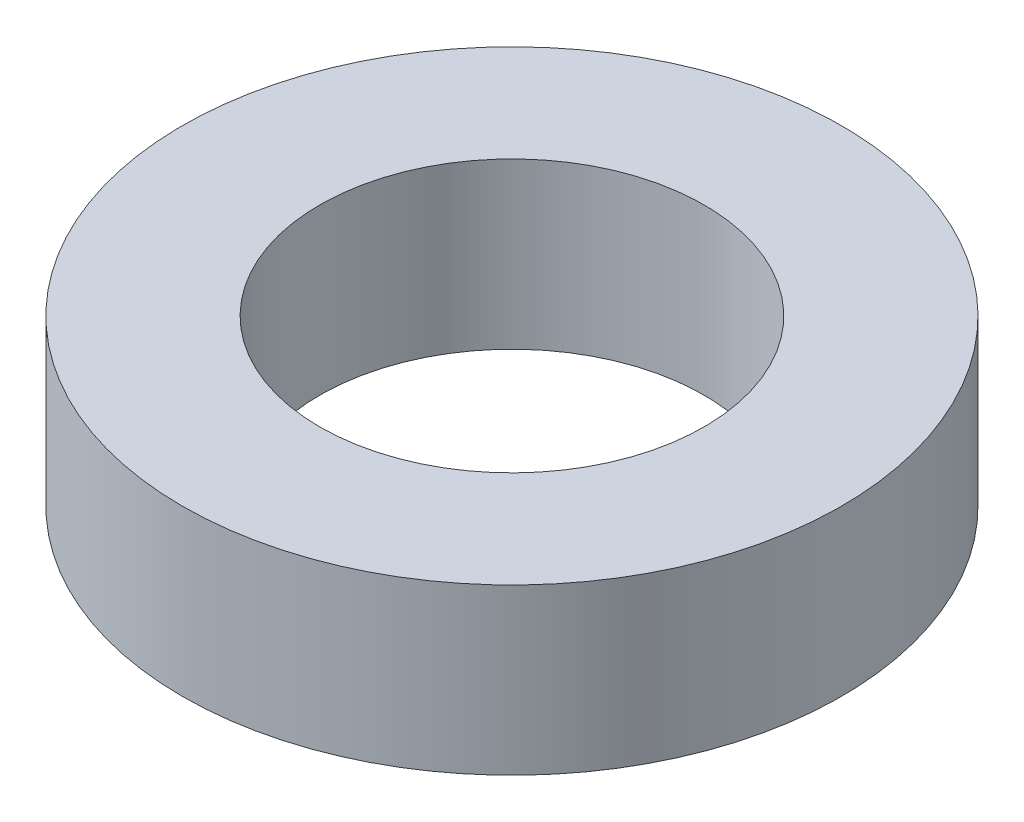
ISO-10303-21;
HEADER;
FILE_DESCRIPTION(('STEP AP214'),'2;1');
FILE_NAME('part.step','',(''),(''),'','','');
FILE_SCHEMA(('AUTOMOTIVE_DESIGN { 1 0 10303 214 1 1 1 1 }'));
ENDSEC;
DATA;
#1=APPLICATION_CONTEXT('core data for automotive mechanical design processes');
#2=APPLICATION_PROTOCOL_DEFINITION('international standard','automotive_design',2000,#1);
#3=PRODUCT_CONTEXT('',#1,'mechanical');
#4=PRODUCT('Part','Part','',(#3));
#5=PRODUCT_RELATED_PRODUCT_CATEGORY('part','',(#4));
#6=PRODUCT_DEFINITION_FORMATION('','',#4);
#7=PRODUCT_DEFINITION_CONTEXT('part definition',#1,'design');
#8=PRODUCT_DEFINITION('design','',#6,#7);
#9=PRODUCT_DEFINITION_SHAPE('','',#8);
#10=(LENGTH_UNIT() NAMED_UNIT(*) SI_UNIT(.MILLI.,.METRE.));
#11=(NAMED_UNIT(*) PLANE_ANGLE_UNIT() SI_UNIT($,.RADIAN.));
#12=(NAMED_UNIT(*) SI_UNIT($,.STERADIAN.) SOLID_ANGLE_UNIT());
#13=UNCERTAINTY_MEASURE_WITH_UNIT(LENGTH_MEASURE(1.E-05),#10,'distance_accuracy_value','');
#14=(GEOMETRIC_REPRESENTATION_CONTEXT(3) GLOBAL_UNCERTAINTY_ASSIGNED_CONTEXT((#13)) GLOBAL_UNIT_ASSIGNED_CONTEXT((#10,
#11,#12)) REPRESENTATION_CONTEXT('',''));
#15=CARTESIAN_POINT('',(0.,0.,0.));
#16=DIRECTION('',(0.,0.,1.));
#17=DIRECTION('',(1.,0.,0.));
#18=AXIS2_PLACEMENT_3D('',#15,#16,#17);
#19=CARTESIAN_POINT('',(0.,1.5,0.));
#20=DIRECTION('',(0.,1.,0.));
#21=DIRECTION('',(0.,0.,1.));
#22=AXIS2_PLACEMENT_3D('',#19,#20,#21);
#23=PLANE('',#22);
#24=CARTESIAN_POINT('',(0.,1.5,0.));
#25=DIRECTION('',(0.,1.,0.));
#26=DIRECTION('',(0.,0.,1.));
#27=AXIS2_PLACEMENT_3D('',#24,#25,#26);
#28=CIRCLE('',#27,3.);
#29=CARTESIAN_POINT('',(0.,1.5,3.));
#30=VERTEX_POINT('',#29);
#31=EDGE_CURVE('E10',#30,#30,#28,.T.);
#32=ORIENTED_EDGE('',*,*,#31,.T.);
#33=EDGE_LOOP('',(#32));
#34=FACE_BOUND('',#33,.T.);
#35=CARTESIAN_POINT('',(0.,1.5,0.));
#36=DIRECTION('',(0.,1.,0.));
#37=DIRECTION('',(0.,0.,1.));
#38=AXIS2_PLACEMENT_3D('',#35,#36,#37);
#39=CIRCLE('',#38,1.75);
#40=CARTESIAN_POINT('',(0.,1.5,1.75));
#41=VERTEX_POINT('',#40);
#42=EDGE_CURVE('E52',#41,#41,#39,.T.);
#43=ORIENTED_EDGE('',*,*,#42,.F.);
#44=EDGE_LOOP('',(#43));
#45=FACE_BOUND('',#44,.T.);
#46=ADVANCED_FACE('F39',(#34,#45),#23,.T.);
#47=CARTESIAN_POINT('',(0.,0.,0.));
#48=DIRECTION('',(0.,1.,0.));
#49=DIRECTION('',(0.,0.,1.));
#50=AXIS2_PLACEMENT_3D('',#47,#48,#49);
#51=PLANE('',#50);
#52=CARTESIAN_POINT('',(0.,0.,0.));
#53=DIRECTION('',(0.,1.,0.));
#54=DIRECTION('',(0.,0.,1.));
#55=AXIS2_PLACEMENT_3D('',#52,#53,#54);
#56=CIRCLE('',#55,3.);
#57=CARTESIAN_POINT('',(0.,0.,3.));
#58=VERTEX_POINT('',#57);
#59=EDGE_CURVE('E43',#58,#58,#56,.T.);
#60=ORIENTED_EDGE('',*,*,#59,.F.);
#61=EDGE_LOOP('',(#60));
#62=FACE_BOUND('',#61,.T.);
#63=CARTESIAN_POINT('',(0.,0.,0.));
#64=DIRECTION('',(0.,1.,0.));
#65=DIRECTION('',(0.,0.,1.));
#66=AXIS2_PLACEMENT_3D('',#63,#64,#65);
#67=CIRCLE('',#66,1.75);
#68=CARTESIAN_POINT('',(0.,0.,1.75));
#69=VERTEX_POINT('',#68);
#70=EDGE_CURVE('E54',#69,#69,#67,.T.);
#71=ORIENTED_EDGE('',*,*,#70,.T.);
#72=EDGE_LOOP('',(#71));
#73=FACE_BOUND('',#72,.T.);
#74=ADVANCED_FACE('F66',(#62,#73),#51,.F.);
#75=CARTESIAN_POINT('',(0.,1.5,0.));
#76=DIRECTION('',(0.,-1.,0.));
#77=DIRECTION('',(0.,0.,-1.));
#78=AXIS2_PLACEMENT_3D('',#75,#76,#77);
#79=CYLINDRICAL_SURFACE('',#78,3.);
#80=ORIENTED_EDGE('',*,*,#31,.F.);
#81=EDGE_LOOP('',(#80));
#82=FACE_BOUND('',#81,.T.);
#83=ORIENTED_EDGE('',*,*,#59,.T.);
#84=EDGE_LOOP('',(#83));
#85=FACE_BOUND('',#84,.T.);
#86=ADVANCED_FACE('F41',(#82,#85),#79,.T.);
#87=CARTESIAN_POINT('',(0.,1.5,0.));
#88=DIRECTION('',(0.,-1.,0.));
#89=DIRECTION('',(0.,0.,-1.));
#90=AXIS2_PLACEMENT_3D('',#87,#88,#89);
#91=CYLINDRICAL_SURFACE('',#90,1.75);
#92=ORIENTED_EDGE('',*,*,#42,.T.);
#93=EDGE_LOOP('',(#92));
#94=FACE_BOUND('',#93,.T.);
#95=ORIENTED_EDGE('',*,*,#70,.F.);
#96=EDGE_LOOP('',(#95));
#97=FACE_BOUND('',#96,.T.);
#98=ADVANCED_FACE('F62',(#94,#97),#91,.F.);
#99=CLOSED_SHELL('',(#46,#74,#86,#98));
#100=MANIFOLD_SOLID_BREP('B2',#99);
#101=ADVANCED_BREP_SHAPE_REPRESENTATION('',(#18,#100),#14);
#102=SHAPE_DEFINITION_REPRESENTATION(#9,#101);
ENDSEC;
END-ISO-10303-21;
